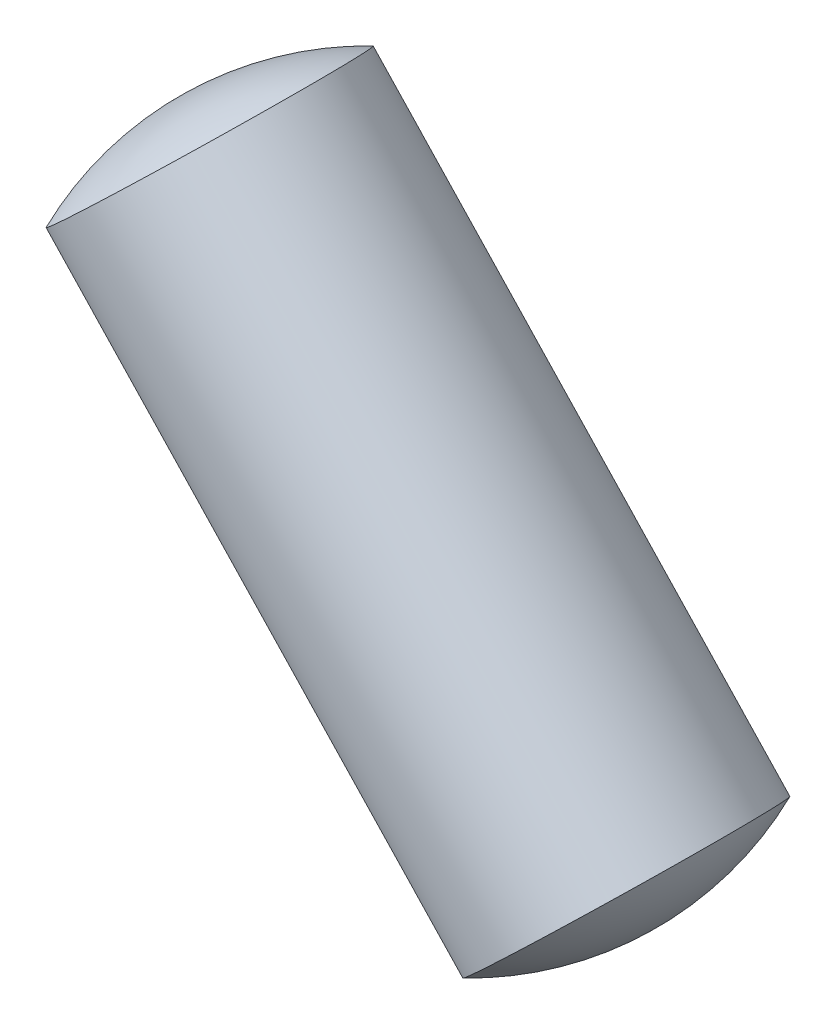
ISO-10303-21;
HEADER;
FILE_DESCRIPTION(('STEP AP214'),'2;1');
FILE_NAME('part.step','',(''),(''),'','','');
FILE_SCHEMA(('AUTOMOTIVE_DESIGN { 1 0 10303 214 1 1 1 1 }'));
ENDSEC;
DATA;
#1=APPLICATION_CONTEXT('core data for automotive mechanical design processes');
#2=APPLICATION_PROTOCOL_DEFINITION('international standard','automotive_design',2000,#1);
#3=PRODUCT_CONTEXT('',#1,'mechanical');
#4=PRODUCT('Part','Part','',(#3));
#5=PRODUCT_RELATED_PRODUCT_CATEGORY('part','',(#4));
#6=PRODUCT_DEFINITION_FORMATION('','',#4);
#7=PRODUCT_DEFINITION_CONTEXT('part definition',#1,'design');
#8=PRODUCT_DEFINITION('design','',#6,#7);
#9=PRODUCT_DEFINITION_SHAPE('','',#8);
#10=(LENGTH_UNIT() NAMED_UNIT(*) SI_UNIT(.MILLI.,.METRE.));
#11=(NAMED_UNIT(*) PLANE_ANGLE_UNIT() SI_UNIT($,.RADIAN.));
#12=(NAMED_UNIT(*) SI_UNIT($,.STERADIAN.) SOLID_ANGLE_UNIT());
#13=UNCERTAINTY_MEASURE_WITH_UNIT(LENGTH_MEASURE(1.E-05),#10,'distance_accuracy_value','');
#14=(GEOMETRIC_REPRESENTATION_CONTEXT(3) GLOBAL_UNCERTAINTY_ASSIGNED_CONTEXT((#13)) GLOBAL_UNIT_ASSIGNED_CONTEXT((#10,
#11,#12)) REPRESENTATION_CONTEXT('',''));
#15=CARTESIAN_POINT('',(0.,0.,0.));
#16=DIRECTION('',(0.,0.,1.));
#17=DIRECTION('',(1.,0.,0.));
#18=AXIS2_PLACEMENT_3D('',#15,#16,#17);
#19=CARTESIAN_POINT('',(-15.3142312226665,16.2278163571911,0.6));
#20=DIRECTION('',(0.727282450080411,0.686338282339718,0.));
#21=DIRECTION('',(-0.686338282339718,0.727282450080411,0.));
#22=AXIS2_PLACEMENT_3D('',#19,#20,#21);
#23=SPHERICAL_SURFACE('',#22,2.);
#24=CARTESIAN_POINT('',(-15.3142312226665,16.2278163571911,0.6));
#25=DIRECTION('',(0.686338282339718,-0.727282450080411,0.));
#26=DIRECTION('',(0.,0.,-1.));
#27=AXIS2_PLACEMENT_3D('',#24,#25,#26);
#28=SPHERICAL_SURFACE('',#27,2.);
#29=CARTESIAN_POINT('',(-16.5030039988585,17.4875065121835,0.6));
#30=DIRECTION('',(0.686338282339718,-0.727282450080411,0.));
#31=DIRECTION('',(0.,0.,-1.));
#32=AXIS2_PLACEMENT_3D('',#29,#30,#31);
#33=CIRCLE('',#32,1.);
#34=CARTESIAN_POINT('',(-16.5030039988585,17.4875065121835,-0.4));
#35=VERTEX_POINT('',#34);
#36=EDGE_CURVE('E11',#35,#35,#33,.T.);
#37=ORIENTED_EDGE('',*,*,#36,.F.);
#38=EDGE_LOOP('',(#37));
#39=FACE_BOUND('',#38,.T.);
#40=ADVANCED_FACE('F17',(#39),#28,.T.);
#41=CARTESIAN_POINT('',(-14.5414840591112,15.4089702213069,0.6));
#42=DIRECTION('',(0.727282450080411,0.686338282339718,0.));
#43=DIRECTION('',(0.686338282339718,-0.727282450080411,0.));
#44=AXIS2_PLACEMENT_3D('',#41,#42,#43);
#45=SPHERICAL_SURFACE('',#44,2.);
#46=CARTESIAN_POINT('',(-14.5414840591112,15.4089702213069,0.6));
#47=DIRECTION('',(0.686338282339718,-0.727282450080411,0.));
#48=DIRECTION('',(0.,0.,-1.));
#49=AXIS2_PLACEMENT_3D('',#46,#47,#48);
#50=SPHERICAL_SURFACE('',#49,2.);
#51=CARTESIAN_POINT('',(-13.3527112829192,14.1492800663144,0.6));
#52=DIRECTION('',(0.686338282339718,-0.727282450080411,0.));
#53=DIRECTION('',(0.,0.,-1.));
#54=AXIS2_PLACEMENT_3D('',#51,#52,#53);
#55=CIRCLE('',#54,1.);
#56=CARTESIAN_POINT('',(-13.3527112829192,14.1492800663144,-0.4));
#57=VERTEX_POINT('',#56);
#58=EDGE_CURVE('E26',#57,#57,#55,.T.);
#59=ORIENTED_EDGE('',*,*,#58,.T.);
#60=EDGE_LOOP('',(#59));
#61=FACE_BOUND('',#60,.T.);
#62=ADVANCED_FACE('F39',(#61),#50,.T.);
#63=CARTESIAN_POINT('',(-14.140284461904,14.9838366777817,0.6));
#64=DIRECTION('',(0.686338282339718,-0.727282450080411,0.));
#65=DIRECTION('',(0.,0.,-1.));
#66=AXIS2_PLACEMENT_3D('',#63,#64,#65);
#67=CYLINDRICAL_SURFACE('',#66,1.);
#68=ORIENTED_EDGE('',*,*,#36,.T.);
#69=EDGE_LOOP('',(#68));
#70=FACE_BOUND('',#69,.T.);
#71=ORIENTED_EDGE('',*,*,#58,.F.);
#72=EDGE_LOOP('',(#71));
#73=FACE_BOUND('',#72,.T.);
#74=ADVANCED_FACE('F47',(#70,#73),#67,.T.);
#75=CLOSED_SHELL('',(#40,#62,#74));
#76=MANIFOLD_SOLID_BREP('B1',#75);
#77=ADVANCED_BREP_SHAPE_REPRESENTATION('',(#18,#76),#14);
#78=SHAPE_DEFINITION_REPRESENTATION(#9,#77);
ENDSEC;
END-ISO-10303-21;
